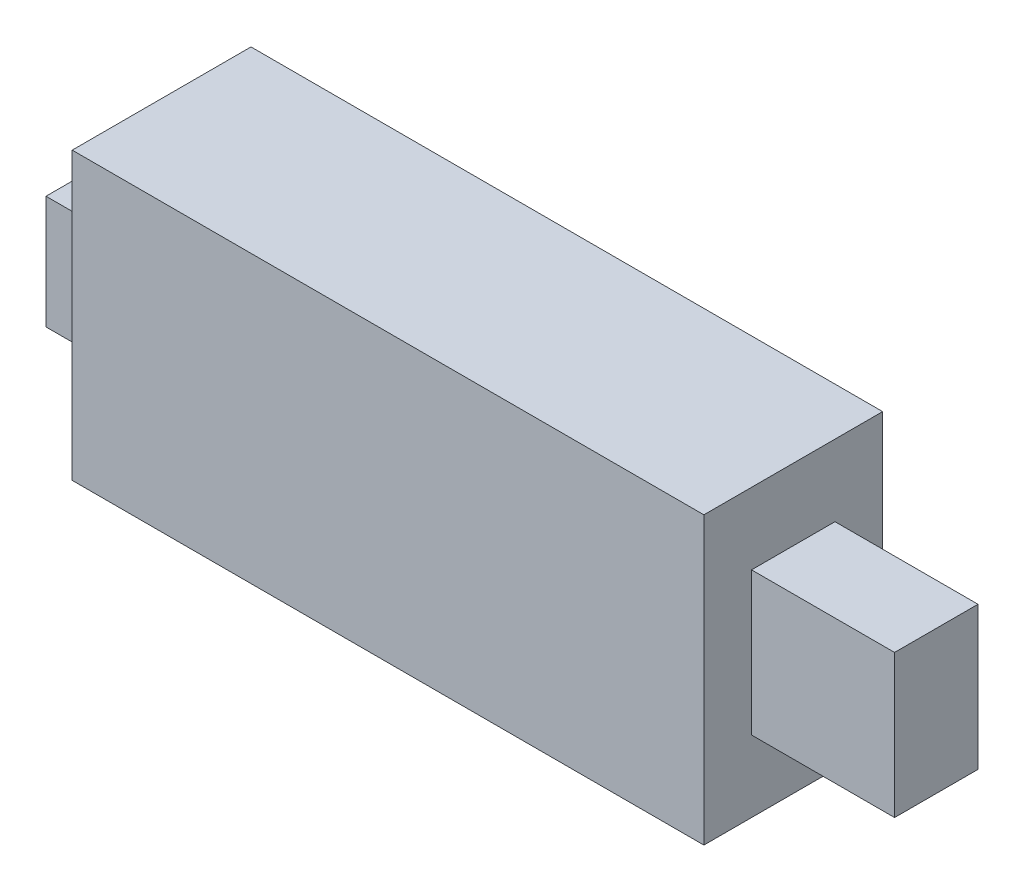
ISO-10303-21;
HEADER;
FILE_DESCRIPTION(('STEP AP214'),'2;1');
FILE_NAME('part.step','',(''),(''),'','','');
FILE_SCHEMA(('AUTOMOTIVE_DESIGN { 1 0 10303 214 1 1 1 1 }'));
ENDSEC;
DATA;
#1=APPLICATION_CONTEXT('core data for automotive mechanical design processes');
#2=APPLICATION_PROTOCOL_DEFINITION('international standard','automotive_design',2000,#1);
#3=PRODUCT_CONTEXT('',#1,'mechanical');
#4=PRODUCT('Part','Part','',(#3));
#5=PRODUCT_RELATED_PRODUCT_CATEGORY('part','',(#4));
#6=PRODUCT_DEFINITION_FORMATION('','',#4);
#7=PRODUCT_DEFINITION_CONTEXT('part definition',#1,'design');
#8=PRODUCT_DEFINITION('design','',#6,#7);
#9=PRODUCT_DEFINITION_SHAPE('','',#8);
#10=(LENGTH_UNIT() NAMED_UNIT(*) SI_UNIT(.MILLI.,.METRE.));
#11=(NAMED_UNIT(*) PLANE_ANGLE_UNIT() SI_UNIT($,.RADIAN.));
#12=(NAMED_UNIT(*) SI_UNIT($,.STERADIAN.) SOLID_ANGLE_UNIT());
#13=UNCERTAINTY_MEASURE_WITH_UNIT(LENGTH_MEASURE(1.E-05),#10,'distance_accuracy_value','');
#14=(GEOMETRIC_REPRESENTATION_CONTEXT(3) GLOBAL_UNCERTAINTY_ASSIGNED_CONTEXT((#13)) GLOBAL_UNIT_ASSIGNED_CONTEXT((#10,
#11,#12)) REPRESENTATION_CONTEXT('',''));
#15=CARTESIAN_POINT('',(0.,0.,0.));
#16=DIRECTION('',(0.,0.,1.));
#17=DIRECTION('',(1.,0.,0.));
#18=AXIS2_PLACEMENT_3D('',#15,#16,#17);
#19=CARTESIAN_POINT('',(-26.5,12.,15.));
#20=DIRECTION('',(1.,0.,0.));
#21=DIRECTION('',(0.,0.,-1.));
#22=AXIS2_PLACEMENT_3D('',#19,#20,#21);
#23=PLANE('',#22);
#24=DIRECTION('',(0.,-1.,0.));
#25=VECTOR('',#24,1.);
#26=CARTESIAN_POINT('',(-26.5,12.,0.));
#27=LINE('',#26,#25);
#28=CARTESIAN_POINT('',(-26.5,12.,0.));
#29=VERTEX_POINT('',#28);
#30=CARTESIAN_POINT('',(-26.5,-12.,0.));
#31=VERTEX_POINT('',#30);
#32=EDGE_CURVE('E184',#29,#31,#27,.T.);
#33=ORIENTED_EDGE('',*,*,#32,.T.);
#34=DIRECTION('',(0.,0.,-1.));
#35=VECTOR('',#34,1.);
#36=CARTESIAN_POINT('',(-26.5,-12.,15.));
#37=LINE('',#36,#35);
#38=CARTESIAN_POINT('',(-26.5,-12.,15.));
#39=VERTEX_POINT('',#38);
#40=EDGE_CURVE('E11',#39,#31,#37,.T.);
#41=ORIENTED_EDGE('',*,*,#40,.F.);
#42=DIRECTION('',(0.,-1.,0.));
#43=VECTOR('',#42,1.);
#44=CARTESIAN_POINT('',(-26.5,12.,15.));
#45=LINE('',#44,#43);
#46=CARTESIAN_POINT('',(-26.5,12.,15.));
#47=VERTEX_POINT('',#46);
#48=EDGE_CURVE('E185',#47,#39,#45,.T.);
#49=ORIENTED_EDGE('',*,*,#48,.F.);
#50=DIRECTION('',(0.,0.,-1.));
#51=VECTOR('',#50,1.);
#52=CARTESIAN_POINT('',(-26.5,12.,15.));
#53=LINE('',#52,#51);
#54=EDGE_CURVE('E195',#47,#29,#53,.T.);
#55=ORIENTED_EDGE('',*,*,#54,.T.);
#56=EDGE_LOOP('',(#33,#41,#49,#55));
#57=FACE_BOUND('',#56,.T.);
#58=DIRECTION('',(0.,-1.,0.));
#59=VECTOR('',#58,1.);
#60=CARTESIAN_POINT('',(-26.5,-4.75,2.8));
#61=LINE('',#60,#59);
#62=CARTESIAN_POINT('',(-26.5,4.75,2.8));
#63=VERTEX_POINT('',#62);
#64=CARTESIAN_POINT('',(-26.5,-4.75,2.8));
#65=VERTEX_POINT('',#64);
#66=EDGE_CURVE('E52',#63,#65,#61,.T.);
#67=ORIENTED_EDGE('',*,*,#66,.F.);
#68=DIRECTION('',(0.,0.,-1.));
#69=VECTOR('',#68,1.);
#70=CARTESIAN_POINT('',(-26.5,4.75,12.2));
#71=LINE('',#70,#69);
#72=CARTESIAN_POINT('',(-26.5,4.75,12.2));
#73=VERTEX_POINT('',#72);
#74=EDGE_CURVE('E56',#73,#63,#71,.T.);
#75=ORIENTED_EDGE('',*,*,#74,.F.);
#76=DIRECTION('',(0.,1.,0.));
#77=VECTOR('',#76,1.);
#78=CARTESIAN_POINT('',(-26.5,-4.75,12.2));
#79=LINE('',#78,#77);
#80=CARTESIAN_POINT('',(-26.5,-4.75,12.2));
#81=VERTEX_POINT('',#80);
#82=EDGE_CURVE('E405',#81,#73,#79,.T.);
#83=ORIENTED_EDGE('',*,*,#82,.F.);
#84=DIRECTION('',(0.,0.,1.));
#85=VECTOR('',#84,1.);
#86=CARTESIAN_POINT('',(-26.5,-4.75,12.2));
#87=LINE('',#86,#85);
#88=EDGE_CURVE('E411',#65,#81,#87,.T.);
#89=ORIENTED_EDGE('',*,*,#88,.F.);
#90=EDGE_LOOP('',(#67,#75,#83,#89));
#91=FACE_BOUND('',#90,.T.);
#92=ADVANCED_FACE('F38',(#57,#91),#23,.F.);
#93=CARTESIAN_POINT('',(26.5,12.,15.));
#94=DIRECTION('',(-1.,0.,0.));
#95=DIRECTION('',(0.,0.,1.));
#96=AXIS2_PLACEMENT_3D('',#93,#94,#95);
#97=PLANE('',#96);
#98=DIRECTION('',(0.,1.,0.));
#99=VECTOR('',#98,1.);
#100=CARTESIAN_POINT('',(26.5,12.,0.));
#101=LINE('',#100,#99);
#102=CARTESIAN_POINT('',(26.5,-12.,0.));
#103=VERTEX_POINT('',#102);
#104=CARTESIAN_POINT('',(26.5,12.,0.));
#105=VERTEX_POINT('',#104);
#106=EDGE_CURVE('E200',#103,#105,#101,.T.);
#107=ORIENTED_EDGE('',*,*,#106,.T.);
#108=DIRECTION('',(0.,0.,-1.));
#109=VECTOR('',#108,1.);
#110=CARTESIAN_POINT('',(26.5,12.,15.));
#111=LINE('',#110,#109);
#112=CARTESIAN_POINT('',(26.5,12.,15.));
#113=VERTEX_POINT('',#112);
#114=EDGE_CURVE('E205',#113,#105,#111,.T.);
#115=ORIENTED_EDGE('',*,*,#114,.F.);
#116=DIRECTION('',(0.,1.,0.));
#117=VECTOR('',#116,1.);
#118=CARTESIAN_POINT('',(26.5,12.,15.));
#119=LINE('',#118,#117);
#120=CARTESIAN_POINT('',(26.5,-12.,15.));
#121=VERTEX_POINT('',#120);
#122=EDGE_CURVE('E191',#121,#113,#119,.T.);
#123=ORIENTED_EDGE('',*,*,#122,.F.);
#124=DIRECTION('',(0.,0.,-1.));
#125=VECTOR('',#124,1.);
#126=CARTESIAN_POINT('',(26.5,-12.,15.));
#127=LINE('',#126,#125);
#128=EDGE_CURVE('E45',#121,#103,#127,.T.);
#129=ORIENTED_EDGE('',*,*,#128,.T.);
#130=EDGE_LOOP('',(#107,#115,#123,#129));
#131=FACE_BOUND('',#130,.T.);
#132=DIRECTION('',(0.,-1.,0.));
#133=VECTOR('',#132,1.);
#134=CARTESIAN_POINT('',(26.5,-6.,11.));
#135=LINE('',#134,#133);
#136=CARTESIAN_POINT('',(26.5,6.,11.));
#137=VERTEX_POINT('',#136);
#138=CARTESIAN_POINT('',(26.5,-6.,11.));
#139=VERTEX_POINT('',#138);
#140=EDGE_CURVE('E146',#137,#139,#135,.T.);
#141=ORIENTED_EDGE('',*,*,#140,.F.);
#142=DIRECTION('',(0.,0.,1.));
#143=VECTOR('',#142,1.);
#144=CARTESIAN_POINT('',(26.5,6.,4.));
#145=LINE('',#144,#143);
#146=CARTESIAN_POINT('',(26.5,6.,4.));
#147=VERTEX_POINT('',#146);
#148=EDGE_CURVE('E159',#147,#137,#145,.T.);
#149=ORIENTED_EDGE('',*,*,#148,.F.);
#150=DIRECTION('',(0.,1.,0.));
#151=VECTOR('',#150,1.);
#152=CARTESIAN_POINT('',(26.5,-6.,4.));
#153=LINE('',#152,#151);
#154=CARTESIAN_POINT('',(26.5,-6.,4.));
#155=VERTEX_POINT('',#154);
#156=EDGE_CURVE('E168',#155,#147,#153,.T.);
#157=ORIENTED_EDGE('',*,*,#156,.F.);
#158=DIRECTION('',(0.,0.,-1.));
#159=VECTOR('',#158,1.);
#160=CARTESIAN_POINT('',(26.5,-6.,4.));
#161=LINE('',#160,#159);
#162=EDGE_CURVE('E149',#139,#155,#161,.T.);
#163=ORIENTED_EDGE('',*,*,#162,.F.);
#164=EDGE_LOOP('',(#141,#149,#157,#163));
#165=FACE_BOUND('',#164,.T.);
#166=ADVANCED_FACE('F212',(#131,#165),#97,.F.);
#167=CARTESIAN_POINT('',(-26.5,-12.,15.));
#168=DIRECTION('',(0.,1.,0.));
#169=DIRECTION('',(0.,0.,1.));
#170=AXIS2_PLACEMENT_3D('',#167,#168,#169);
#171=PLANE('',#170);
#172=DIRECTION('',(1.,0.,0.));
#173=VECTOR('',#172,1.);
#174=CARTESIAN_POINT('',(-26.5,-12.,0.));
#175=LINE('',#174,#173);
#176=EDGE_CURVE('E198',#31,#103,#175,.T.);
#177=ORIENTED_EDGE('',*,*,#176,.T.);
#178=ORIENTED_EDGE('',*,*,#128,.F.);
#179=DIRECTION('',(1.,0.,0.));
#180=VECTOR('',#179,1.);
#181=CARTESIAN_POINT('',(-26.5,-12.,15.));
#182=LINE('',#181,#180);
#183=EDGE_CURVE('E188',#39,#121,#182,.T.);
#184=ORIENTED_EDGE('',*,*,#183,.F.);
#185=ORIENTED_EDGE('',*,*,#40,.T.);
#186=EDGE_LOOP('',(#177,#178,#184,#185));
#187=FACE_BOUND('',#186,.T.);
#188=ADVANCED_FACE('F229',(#187),#171,.F.);
#189=CARTESIAN_POINT('',(-26.5,12.,15.));
#190=DIRECTION('',(0.,-1.,0.));
#191=DIRECTION('',(0.,0.,-1.));
#192=AXIS2_PLACEMENT_3D('',#189,#190,#191);
#193=PLANE('',#192);
#194=DIRECTION('',(-1.,0.,0.));
#195=VECTOR('',#194,1.);
#196=CARTESIAN_POINT('',(-26.5,12.,0.));
#197=LINE('',#196,#195);
#198=EDGE_CURVE('E189',#105,#29,#197,.T.);
#199=ORIENTED_EDGE('',*,*,#198,.T.);
#200=ORIENTED_EDGE('',*,*,#54,.F.);
#201=DIRECTION('',(-1.,0.,0.));
#202=VECTOR('',#201,1.);
#203=CARTESIAN_POINT('',(-26.5,12.,15.));
#204=LINE('',#203,#202);
#205=EDGE_CURVE('E193',#113,#47,#204,.T.);
#206=ORIENTED_EDGE('',*,*,#205,.F.);
#207=ORIENTED_EDGE('',*,*,#114,.T.);
#208=EDGE_LOOP('',(#199,#200,#206,#207));
#209=FACE_BOUND('',#208,.T.);
#210=ADVANCED_FACE('F222',(#209),#193,.F.);
#211=CARTESIAN_POINT('',(0.,0.,15.));
#212=DIRECTION('',(0.,0.,1.));
#213=DIRECTION('',(1.,0.,0.));
#214=AXIS2_PLACEMENT_3D('',#211,#212,#213);
#215=PLANE('',#214);
#216=ORIENTED_EDGE('',*,*,#48,.T.);
#217=ORIENTED_EDGE('',*,*,#183,.T.);
#218=ORIENTED_EDGE('',*,*,#122,.T.);
#219=ORIENTED_EDGE('',*,*,#205,.T.);
#220=EDGE_LOOP('',(#216,#217,#218,#219));
#221=FACE_BOUND('',#220,.T.);
#222=ADVANCED_FACE('F228',(#221),#215,.T.);
#223=CARTESIAN_POINT('',(0.,0.,0.));
#224=DIRECTION('',(0.,0.,1.));
#225=DIRECTION('',(1.,0.,0.));
#226=AXIS2_PLACEMENT_3D('',#223,#224,#225);
#227=PLANE('',#226);
#228=ORIENTED_EDGE('',*,*,#32,.F.);
#229=ORIENTED_EDGE('',*,*,#198,.F.);
#230=ORIENTED_EDGE('',*,*,#106,.F.);
#231=ORIENTED_EDGE('',*,*,#176,.F.);
#232=EDGE_LOOP('',(#228,#229,#230,#231));
#233=FACE_BOUND('',#232,.T.);
#234=ADVANCED_FACE('F219',(#233),#227,.F.);
#235=CARTESIAN_POINT('',(38.5,-6.,11.));
#236=DIRECTION('',(0.,0.,-1.));
#237=DIRECTION('',(-1.,0.,0.));
#238=AXIS2_PLACEMENT_3D('',#235,#236,#237);
#239=PLANE('',#238);
#240=ORIENTED_EDGE('',*,*,#140,.T.);
#241=DIRECTION('',(-1.,0.,0.));
#242=VECTOR('',#241,1.);
#243=CARTESIAN_POINT('',(38.5,-6.,11.));
#244=LINE('',#243,#242);
#245=CARTESIAN_POINT('',(38.5,-6.,11.));
#246=VERTEX_POINT('',#245);
#247=EDGE_CURVE('E181',#246,#139,#244,.T.);
#248=ORIENTED_EDGE('',*,*,#247,.F.);
#249=DIRECTION('',(0.,-1.,0.));
#250=VECTOR('',#249,1.);
#251=CARTESIAN_POINT('',(38.5,-6.,11.));
#252=LINE('',#251,#250);
#253=CARTESIAN_POINT('',(38.5,6.,11.));
#254=VERTEX_POINT('',#253);
#255=EDGE_CURVE('E155',#254,#246,#252,.T.);
#256=ORIENTED_EDGE('',*,*,#255,.F.);
#257=DIRECTION('',(-1.,0.,0.));
#258=VECTOR('',#257,1.);
#259=CARTESIAN_POINT('',(38.5,6.,11.));
#260=LINE('',#259,#258);
#261=EDGE_CURVE('E164',#254,#137,#260,.T.);
#262=ORIENTED_EDGE('',*,*,#261,.T.);
#263=EDGE_LOOP('',(#240,#248,#256,#262));
#264=FACE_BOUND('',#263,.T.);
#265=ADVANCED_FACE('F258',(#264),#239,.F.);
#266=CARTESIAN_POINT('',(38.5,-6.,4.));
#267=DIRECTION('',(0.,1.,0.));
#268=DIRECTION('',(0.,0.,1.));
#269=AXIS2_PLACEMENT_3D('',#266,#267,#268);
#270=PLANE('',#269);
#271=ORIENTED_EDGE('',*,*,#162,.T.);
#272=DIRECTION('',(-1.,0.,0.));
#273=VECTOR('',#272,1.);
#274=CARTESIAN_POINT('',(38.5,-6.,4.));
#275=LINE('',#274,#273);
#276=CARTESIAN_POINT('',(38.5,-6.,4.));
#277=VERTEX_POINT('',#276);
#278=EDGE_CURVE('E178',#277,#155,#275,.T.);
#279=ORIENTED_EDGE('',*,*,#278,.F.);
#280=DIRECTION('',(0.,0.,-1.));
#281=VECTOR('',#280,1.);
#282=CARTESIAN_POINT('',(38.5,-6.,4.));
#283=LINE('',#282,#281);
#284=EDGE_CURVE('E158',#246,#277,#283,.T.);
#285=ORIENTED_EDGE('',*,*,#284,.F.);
#286=ORIENTED_EDGE('',*,*,#247,.T.);
#287=EDGE_LOOP('',(#271,#279,#285,#286));
#288=FACE_BOUND('',#287,.T.);
#289=ADVANCED_FACE('F263',(#288),#270,.F.);
#290=CARTESIAN_POINT('',(38.5,-6.,4.));
#291=DIRECTION('',(0.,0.,1.));
#292=DIRECTION('',(0.,-1.,0.));
#293=AXIS2_PLACEMENT_3D('',#290,#291,#292);
#294=PLANE('',#293);
#295=ORIENTED_EDGE('',*,*,#156,.T.);
#296=DIRECTION('',(-1.,0.,0.));
#297=VECTOR('',#296,1.);
#298=CARTESIAN_POINT('',(38.5,6.,4.));
#299=LINE('',#298,#297);
#300=CARTESIAN_POINT('',(38.5,6.,4.));
#301=VERTEX_POINT('',#300);
#302=EDGE_CURVE('E175',#301,#147,#299,.T.);
#303=ORIENTED_EDGE('',*,*,#302,.F.);
#304=DIRECTION('',(0.,1.,0.));
#305=VECTOR('',#304,1.);
#306=CARTESIAN_POINT('',(38.5,-6.,4.));
#307=LINE('',#306,#305);
#308=EDGE_CURVE('E161',#277,#301,#307,.T.);
#309=ORIENTED_EDGE('',*,*,#308,.F.);
#310=ORIENTED_EDGE('',*,*,#278,.T.);
#311=EDGE_LOOP('',(#295,#303,#309,#310));
#312=FACE_BOUND('',#311,.T.);
#313=ADVANCED_FACE('F273',(#312),#294,.F.);
#314=CARTESIAN_POINT('',(38.5,6.,4.));
#315=DIRECTION('',(0.,-1.,0.));
#316=DIRECTION('',(0.,0.,-1.));
#317=AXIS2_PLACEMENT_3D('',#314,#315,#316);
#318=PLANE('',#317);
#319=ORIENTED_EDGE('',*,*,#148,.T.);
#320=ORIENTED_EDGE('',*,*,#261,.F.);
#321=DIRECTION('',(0.,0.,1.));
#322=VECTOR('',#321,1.);
#323=CARTESIAN_POINT('',(38.5,6.,4.));
#324=LINE('',#323,#322);
#325=EDGE_CURVE('E163',#301,#254,#324,.T.);
#326=ORIENTED_EDGE('',*,*,#325,.F.);
#327=ORIENTED_EDGE('',*,*,#302,.T.);
#328=EDGE_LOOP('',(#319,#320,#326,#327));
#329=FACE_BOUND('',#328,.T.);
#330=ADVANCED_FACE('F284',(#329),#318,.F.);
#331=CARTESIAN_POINT('',(38.5,0.,0.));
#332=DIRECTION('',(1.,0.,0.));
#333=DIRECTION('',(0.,0.,-1.));
#334=AXIS2_PLACEMENT_3D('',#331,#332,#333);
#335=PLANE('',#334);
#336=ORIENTED_EDGE('',*,*,#255,.T.);
#337=ORIENTED_EDGE('',*,*,#284,.T.);
#338=ORIENTED_EDGE('',*,*,#308,.T.);
#339=ORIENTED_EDGE('',*,*,#325,.T.);
#340=EDGE_LOOP('',(#336,#337,#338,#339));
#341=FACE_BOUND('',#340,.T.);
#342=ADVANCED_FACE('F294',(#341),#335,.T.);
#343=CARTESIAN_POINT('',(-31.5,-4.75,2.8));
#344=DIRECTION('',(0.,0.,1.));
#345=DIRECTION('',(1.,0.,0.));
#346=AXIS2_PLACEMENT_3D('',#343,#344,#345);
#347=PLANE('',#346);
#348=ORIENTED_EDGE('',*,*,#66,.T.);
#349=DIRECTION('',(1.,0.,0.));
#350=VECTOR('',#349,1.);
#351=CARTESIAN_POINT('',(-31.5,-4.75,2.8));
#352=LINE('',#351,#350);
#353=CARTESIAN_POINT('',(-31.5,-4.75,2.8));
#354=VERTEX_POINT('',#353);
#355=EDGE_CURVE('E129',#354,#65,#352,.T.);
#356=ORIENTED_EDGE('',*,*,#355,.F.);
#357=DIRECTION('',(0.,-1.,0.));
#358=VECTOR('',#357,1.);
#359=CARTESIAN_POINT('',(-31.5,-4.75,2.8));
#360=LINE('',#359,#358);
#361=CARTESIAN_POINT('',(-31.5,4.75,2.8));
#362=VERTEX_POINT('',#361);
#363=EDGE_CURVE('E135',#362,#354,#360,.T.);
#364=ORIENTED_EDGE('',*,*,#363,.F.);
#365=DIRECTION('',(1.,0.,0.));
#366=VECTOR('',#365,1.);
#367=CARTESIAN_POINT('',(-31.5,4.75,2.8));
#368=LINE('',#367,#366);
#369=EDGE_CURVE('E403',#362,#63,#368,.T.);
#370=ORIENTED_EDGE('',*,*,#369,.T.);
#371=EDGE_LOOP('',(#348,#356,#364,#370));
#372=FACE_BOUND('',#371,.T.);
#373=ADVANCED_FACE('F145',(#372),#347,.F.);
#374=CARTESIAN_POINT('',(-31.5,-4.75,12.2));
#375=DIRECTION('',(0.,1.,0.));
#376=DIRECTION('',(0.,0.,1.));
#377=AXIS2_PLACEMENT_3D('',#374,#375,#376);
#378=PLANE('',#377);
#379=ORIENTED_EDGE('',*,*,#88,.T.);
#380=DIRECTION('',(1.,0.,0.));
#381=VECTOR('',#380,1.);
#382=CARTESIAN_POINT('',(-31.5,-4.75,12.2));
#383=LINE('',#382,#381);
#384=CARTESIAN_POINT('',(-31.5,-4.75,12.2));
#385=VERTEX_POINT('',#384);
#386=EDGE_CURVE('E131',#385,#81,#383,.T.);
#387=ORIENTED_EDGE('',*,*,#386,.F.);
#388=DIRECTION('',(0.,0.,1.));
#389=VECTOR('',#388,1.);
#390=CARTESIAN_POINT('',(-31.5,-4.75,12.2));
#391=LINE('',#390,#389);
#392=EDGE_CURVE('E124',#354,#385,#391,.T.);
#393=ORIENTED_EDGE('',*,*,#392,.F.);
#394=ORIENTED_EDGE('',*,*,#355,.T.);
#395=EDGE_LOOP('',(#379,#387,#393,#394));
#396=FACE_BOUND('',#395,.T.);
#397=ADVANCED_FACE('F127',(#396),#378,.F.);
#398=CARTESIAN_POINT('',(-31.5,-4.75,12.2));
#399=DIRECTION('',(0.,0.,-1.));
#400=DIRECTION('',(-1.,0.,0.));
#401=AXIS2_PLACEMENT_3D('',#398,#399,#400);
#402=PLANE('',#401);
#403=ORIENTED_EDGE('',*,*,#82,.T.);
#404=DIRECTION('',(1.,0.,0.));
#405=VECTOR('',#404,1.);
#406=CARTESIAN_POINT('',(-31.5,4.75,12.2));
#407=LINE('',#406,#405);
#408=CARTESIAN_POINT('',(-31.5,4.75,12.2));
#409=VERTEX_POINT('',#408);
#410=EDGE_CURVE('E151',#409,#73,#407,.T.);
#411=ORIENTED_EDGE('',*,*,#410,.F.);
#412=DIRECTION('',(0.,1.,0.));
#413=VECTOR('',#412,1.);
#414=CARTESIAN_POINT('',(-31.5,-4.75,12.2));
#415=LINE('',#414,#413);
#416=EDGE_CURVE('E134',#385,#409,#415,.T.);
#417=ORIENTED_EDGE('',*,*,#416,.F.);
#418=ORIENTED_EDGE('',*,*,#386,.T.);
#419=EDGE_LOOP('',(#403,#411,#417,#418));
#420=FACE_BOUND('',#419,.T.);
#421=ADVANCED_FACE('F320',(#420),#402,.F.);
#422=CARTESIAN_POINT('',(-31.5,4.75,12.2));
#423=DIRECTION('',(0.,-1.,0.));
#424=DIRECTION('',(0.,0.,-1.));
#425=AXIS2_PLACEMENT_3D('',#422,#423,#424);
#426=PLANE('',#425);
#427=ORIENTED_EDGE('',*,*,#74,.T.);
#428=ORIENTED_EDGE('',*,*,#369,.F.);
#429=DIRECTION('',(0.,0.,-1.));
#430=VECTOR('',#429,1.);
#431=CARTESIAN_POINT('',(-31.5,4.75,12.2));
#432=LINE('',#431,#430);
#433=EDGE_CURVE('E140',#409,#362,#432,.T.);
#434=ORIENTED_EDGE('',*,*,#433,.F.);
#435=ORIENTED_EDGE('',*,*,#410,.T.);
#436=EDGE_LOOP('',(#427,#428,#434,#435));
#437=FACE_BOUND('',#436,.T.);
#438=ADVANCED_FACE('F327',(#437),#426,.F.);
#439=CARTESIAN_POINT('',(-31.5,0.,0.));
#440=DIRECTION('',(-1.,0.,0.));
#441=DIRECTION('',(0.,0.,1.));
#442=AXIS2_PLACEMENT_3D('',#439,#440,#441);
#443=PLANE('',#442);
#444=ORIENTED_EDGE('',*,*,#363,.T.);
#445=ORIENTED_EDGE('',*,*,#392,.T.);
#446=ORIENTED_EDGE('',*,*,#416,.T.);
#447=ORIENTED_EDGE('',*,*,#433,.T.);
#448=EDGE_LOOP('',(#444,#445,#446,#447));
#449=FACE_BOUND('',#448,.T.);
#450=ADVANCED_FACE('F138',(#449),#443,.T.);
#451=CLOSED_SHELL('',(#92,#166,#188,#210,#222,#234,#265,#289,#313,#330,#342,#373,#397,#421,#438,#450));
#452=MANIFOLD_SOLID_BREP('B2',#451);
#453=ADVANCED_BREP_SHAPE_REPRESENTATION('',(#18,#452),#14);
#454=SHAPE_DEFINITION_REPRESENTATION(#9,#453);
ENDSEC;
END-ISO-10303-21;
